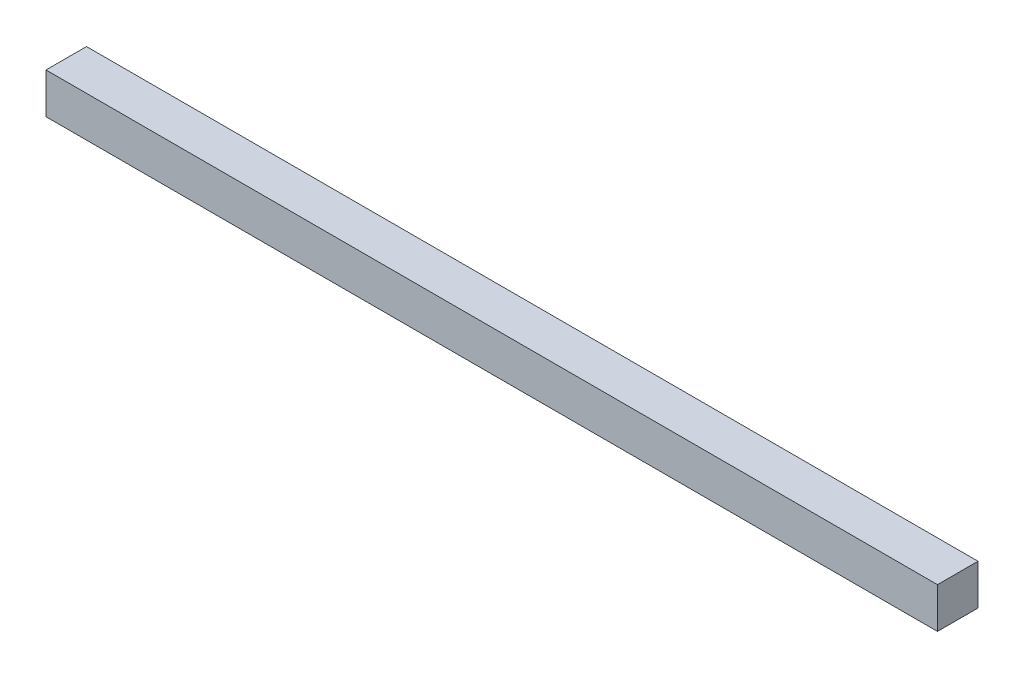
ISO-10303-21;
HEADER;
FILE_DESCRIPTION(('STEP AP214'),'2;1');
FILE_NAME('part.step','',(''),(''),'','','');
FILE_SCHEMA(('AUTOMOTIVE_DESIGN { 1 0 10303 214 1 1 1 1 }'));
ENDSEC;
DATA;
#1=APPLICATION_CONTEXT('core data for automotive mechanical design processes');
#2=APPLICATION_PROTOCOL_DEFINITION('international standard','automotive_design',2000,#1);
#3=PRODUCT_CONTEXT('',#1,'mechanical');
#4=PRODUCT('Part','Part','',(#3));
#5=PRODUCT_RELATED_PRODUCT_CATEGORY('part','',(#4));
#6=PRODUCT_DEFINITION_FORMATION('','',#4);
#7=PRODUCT_DEFINITION_CONTEXT('part definition',#1,'design');
#8=PRODUCT_DEFINITION('design','',#6,#7);
#9=PRODUCT_DEFINITION_SHAPE('','',#8);
#10=(LENGTH_UNIT() NAMED_UNIT(*) SI_UNIT(.MILLI.,.METRE.));
#11=(NAMED_UNIT(*) PLANE_ANGLE_UNIT() SI_UNIT($,.RADIAN.));
#12=(NAMED_UNIT(*) SI_UNIT($,.STERADIAN.) SOLID_ANGLE_UNIT());
#13=UNCERTAINTY_MEASURE_WITH_UNIT(LENGTH_MEASURE(1.E-05),#10,'distance_accuracy_value','');
#14=(GEOMETRIC_REPRESENTATION_CONTEXT(3) GLOBAL_UNCERTAINTY_ASSIGNED_CONTEXT((#13)) GLOBAL_UNIT_ASSIGNED_CONTEXT((#10,
#11,#12)) REPRESENTATION_CONTEXT('',''));
#15=CARTESIAN_POINT('',(0.,0.,0.));
#16=DIRECTION('',(0.,0.,1.));
#17=DIRECTION('',(1.,0.,0.));
#18=AXIS2_PLACEMENT_3D('',#15,#16,#17);
#19=CARTESIAN_POINT('',(5499.99999999999,-250.,500.));
#20=DIRECTION('',(-1.,0.,0.));
#21=DIRECTION('',(0.,0.,1.));
#22=AXIS2_PLACEMENT_3D('',#19,#20,#21);
#23=PLANE('',#22);
#24=DIRECTION('',(0.,1.,0.));
#25=VECTOR('',#24,1.);
#26=CARTESIAN_POINT('',(5499.99999999999,-250.,0.));
#27=LINE('',#26,#25);
#28=CARTESIAN_POINT('',(5499.99999999999,-250.,0.));
#29=VERTEX_POINT('',#28);
#30=CARTESIAN_POINT('',(5499.99999999999,250.,0.));
#31=VERTEX_POINT('',#30);
#32=EDGE_CURVE('E96',#29,#31,#27,.T.);
#33=ORIENTED_EDGE('',*,*,#32,.T.);
#34=DIRECTION('',(0.,0.,-1.));
#35=VECTOR('',#34,1.);
#36=CARTESIAN_POINT('',(5499.99999999999,250.,500.));
#37=LINE('',#36,#35);
#38=CARTESIAN_POINT('',(5499.99999999999,250.,500.));
#39=VERTEX_POINT('',#38);
#40=EDGE_CURVE('E11',#39,#31,#37,.T.);
#41=ORIENTED_EDGE('',*,*,#40,.F.);
#42=DIRECTION('',(0.,1.,0.));
#43=VECTOR('',#42,1.);
#44=CARTESIAN_POINT('',(5499.99999999999,-250.,500.));
#45=LINE('',#44,#43);
#46=CARTESIAN_POINT('',(5499.99999999999,-250.,500.));
#47=VERTEX_POINT('',#46);
#48=EDGE_CURVE('E84',#47,#39,#45,.T.);
#49=ORIENTED_EDGE('',*,*,#48,.F.);
#50=DIRECTION('',(0.,0.,-1.));
#51=VECTOR('',#50,1.);
#52=CARTESIAN_POINT('',(5499.99999999999,-250.,500.));
#53=LINE('',#52,#51);
#54=EDGE_CURVE('E92',#47,#29,#53,.T.);
#55=ORIENTED_EDGE('',*,*,#54,.T.);
#56=EDGE_LOOP('',(#33,#41,#49,#55));
#57=FACE_BOUND('',#56,.T.);
#58=ADVANCED_FACE('F33',(#57),#23,.F.);
#59=CARTESIAN_POINT('',(-5500.00000000001,250.,500.));
#60=DIRECTION('',(0.,-1.,0.));
#61=DIRECTION('',(0.,0.,-1.));
#62=AXIS2_PLACEMENT_3D('',#59,#60,#61);
#63=PLANE('',#62);
#64=DIRECTION('',(-1.,0.,0.));
#65=VECTOR('',#64,1.);
#66=CARTESIAN_POINT('',(-5500.00000000001,250.,0.));
#67=LINE('',#66,#65);
#68=CARTESIAN_POINT('',(-5500.00000000001,250.,0.));
#69=VERTEX_POINT('',#68);
#70=EDGE_CURVE('E88',#31,#69,#67,.T.);
#71=ORIENTED_EDGE('',*,*,#70,.T.);
#72=DIRECTION('',(0.,0.,-1.));
#73=VECTOR('',#72,1.);
#74=CARTESIAN_POINT('',(-5500.00000000001,250.,500.));
#75=LINE('',#74,#73);
#76=CARTESIAN_POINT('',(-5500.00000000001,250.,500.));
#77=VERTEX_POINT('',#76);
#78=EDGE_CURVE('E41',#77,#69,#75,.T.);
#79=ORIENTED_EDGE('',*,*,#78,.F.);
#80=DIRECTION('',(-1.,0.,0.));
#81=VECTOR('',#80,1.);
#82=CARTESIAN_POINT('',(-5500.00000000001,250.,500.));
#83=LINE('',#82,#81);
#84=EDGE_CURVE('E79',#39,#77,#83,.T.);
#85=ORIENTED_EDGE('',*,*,#84,.F.);
#86=ORIENTED_EDGE('',*,*,#40,.T.);
#87=EDGE_LOOP('',(#71,#79,#85,#86));
#88=FACE_BOUND('',#87,.T.);
#89=ADVANCED_FACE('F87',(#88),#63,.F.);
#90=CARTESIAN_POINT('',(-5500.00000000001,-250.,500.));
#91=DIRECTION('',(1.,0.,0.));
#92=DIRECTION('',(0.,0.,-1.));
#93=AXIS2_PLACEMENT_3D('',#90,#91,#92);
#94=PLANE('',#93);
#95=DIRECTION('',(0.,-1.,0.));
#96=VECTOR('',#95,1.);
#97=CARTESIAN_POINT('',(-5500.00000000001,-250.,0.));
#98=LINE('',#97,#96);
#99=CARTESIAN_POINT('',(-5500.00000000001,-250.,0.));
#100=VERTEX_POINT('',#99);
#101=EDGE_CURVE('E66',#69,#100,#98,.T.);
#102=ORIENTED_EDGE('',*,*,#101,.T.);
#103=DIRECTION('',(0.,0.,-1.));
#104=VECTOR('',#103,1.);
#105=CARTESIAN_POINT('',(-5500.00000000001,-250.,500.));
#106=LINE('',#105,#104);
#107=CARTESIAN_POINT('',(-5500.00000000001,-250.,500.));
#108=VERTEX_POINT('',#107);
#109=EDGE_CURVE('E89',#108,#100,#106,.T.);
#110=ORIENTED_EDGE('',*,*,#109,.F.);
#111=DIRECTION('',(0.,-1.,0.));
#112=VECTOR('',#111,1.);
#113=CARTESIAN_POINT('',(-5500.00000000001,-250.,500.));
#114=LINE('',#113,#112);
#115=EDGE_CURVE('E82',#77,#108,#114,.T.);
#116=ORIENTED_EDGE('',*,*,#115,.F.);
#117=ORIENTED_EDGE('',*,*,#78,.T.);
#118=EDGE_LOOP('',(#102,#110,#116,#117));
#119=FACE_BOUND('',#118,.T.);
#120=ADVANCED_FACE('F90',(#119),#94,.F.);
#121=CARTESIAN_POINT('',(-5500.00000000001,-250.,500.));
#122=DIRECTION('',(0.,1.,0.));
#123=DIRECTION('',(0.,0.,1.));
#124=AXIS2_PLACEMENT_3D('',#121,#122,#123);
#125=PLANE('',#124);
#126=DIRECTION('',(1.,0.,0.));
#127=VECTOR('',#126,1.);
#128=CARTESIAN_POINT('',(-5500.00000000001,-250.,0.));
#129=LINE('',#128,#127);
#130=EDGE_CURVE('E72',#100,#29,#129,.T.);
#131=ORIENTED_EDGE('',*,*,#130,.T.);
#132=ORIENTED_EDGE('',*,*,#54,.F.);
#133=DIRECTION('',(1.,0.,0.));
#134=VECTOR('',#133,1.);
#135=CARTESIAN_POINT('',(-5500.00000000001,-250.,500.));
#136=LINE('',#135,#134);
#137=EDGE_CURVE('E49',#108,#47,#136,.T.);
#138=ORIENTED_EDGE('',*,*,#137,.F.);
#139=ORIENTED_EDGE('',*,*,#109,.T.);
#140=EDGE_LOOP('',(#131,#132,#138,#139));
#141=FACE_BOUND('',#140,.T.);
#142=ADVANCED_FACE('F103',(#141),#125,.F.);
#143=CARTESIAN_POINT('',(0.,0.,500.));
#144=DIRECTION('',(0.,0.,-1.));
#145=DIRECTION('',(-1.,0.,0.));
#146=AXIS2_PLACEMENT_3D('',#143,#144,#145);
#147=PLANE('',#146);
#148=ORIENTED_EDGE('',*,*,#48,.T.);
#149=ORIENTED_EDGE('',*,*,#84,.T.);
#150=ORIENTED_EDGE('',*,*,#115,.T.);
#151=ORIENTED_EDGE('',*,*,#137,.T.);
#152=EDGE_LOOP('',(#148,#149,#150,#151));
#153=FACE_BOUND('',#152,.T.);
#154=ADVANCED_FACE('F80',(#153),#147,.F.);
#155=CARTESIAN_POINT('',(0.,0.,0.));
#156=DIRECTION('',(0.,0.,-1.));
#157=DIRECTION('',(-1.,0.,0.));
#158=AXIS2_PLACEMENT_3D('',#155,#156,#157);
#159=PLANE('',#158);
#160=ORIENTED_EDGE('',*,*,#32,.F.);
#161=ORIENTED_EDGE('',*,*,#130,.F.);
#162=ORIENTED_EDGE('',*,*,#101,.F.);
#163=ORIENTED_EDGE('',*,*,#70,.F.);
#164=EDGE_LOOP('',(#160,#161,#162,#163));
#165=FACE_BOUND('',#164,.T.);
#166=ADVANCED_FACE('F106',(#165),#159,.T.);
#167=CLOSED_SHELL('',(#58,#89,#120,#142,#154,#166));
#168=MANIFOLD_SOLID_BREP('B2',#167);
#169=ADVANCED_BREP_SHAPE_REPRESENTATION('',(#18,#168),#14);
#170=SHAPE_DEFINITION_REPRESENTATION(#9,#169);
ENDSEC;
END-ISO-10303-21;
